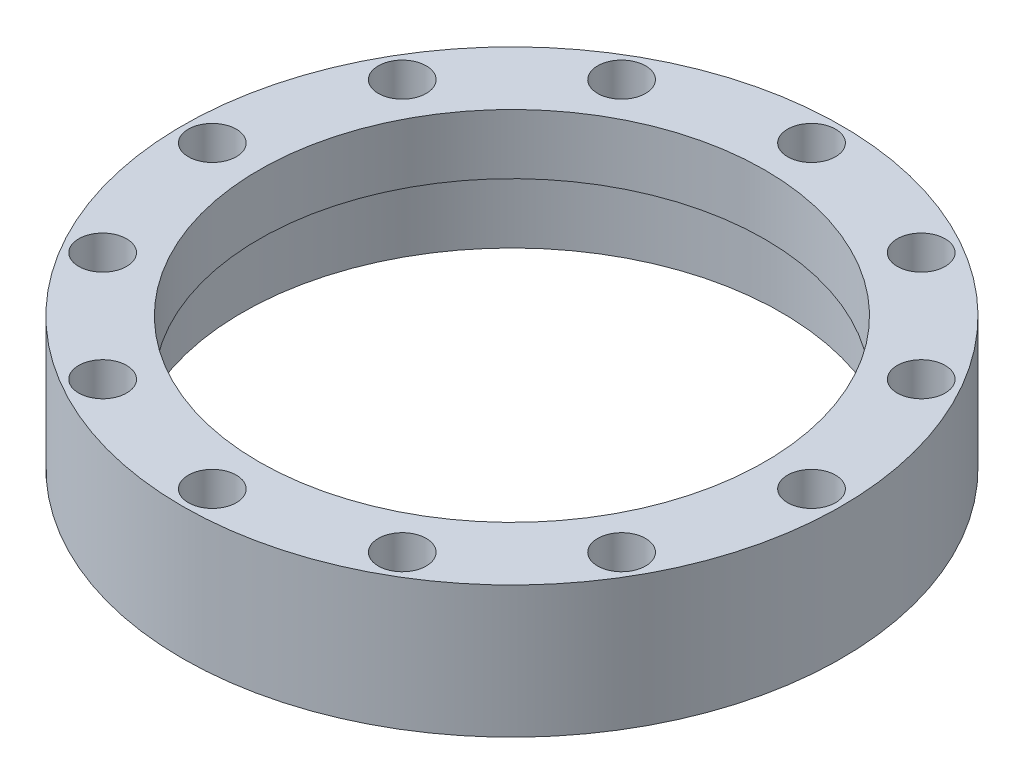
ISO-10303-21;
HEADER;
FILE_DESCRIPTION(('STEP AP214'),'2;1');
FILE_NAME('part.step','',(''),(''),'','','');
FILE_SCHEMA(('AUTOMOTIVE_DESIGN { 1 0 10303 214 1 1 1 1 }'));
ENDSEC;
DATA;
#1=APPLICATION_CONTEXT('core data for automotive mechanical design processes');
#2=APPLICATION_PROTOCOL_DEFINITION('international standard','automotive_design',2000,#1);
#3=PRODUCT_CONTEXT('',#1,'mechanical');
#4=PRODUCT('Part','Part','',(#3));
#5=PRODUCT_RELATED_PRODUCT_CATEGORY('part','',(#4));
#6=PRODUCT_DEFINITION_FORMATION('','',#4);
#7=PRODUCT_DEFINITION_CONTEXT('part definition',#1,'design');
#8=PRODUCT_DEFINITION('design','',#6,#7);
#9=PRODUCT_DEFINITION_SHAPE('','',#8);
#10=(LENGTH_UNIT() NAMED_UNIT(*) SI_UNIT(.MILLI.,.METRE.));
#11=(NAMED_UNIT(*) PLANE_ANGLE_UNIT() SI_UNIT($,.RADIAN.));
#12=(NAMED_UNIT(*) SI_UNIT($,.STERADIAN.) SOLID_ANGLE_UNIT());
#13=UNCERTAINTY_MEASURE_WITH_UNIT(LENGTH_MEASURE(1.E-05),#10,'distance_accuracy_value','');
#14=(GEOMETRIC_REPRESENTATION_CONTEXT(3) GLOBAL_UNCERTAINTY_ASSIGNED_CONTEXT((#13)) GLOBAL_UNIT_ASSIGNED_CONTEXT((#10,
#11,#12)) REPRESENTATION_CONTEXT('',''));
#15=CARTESIAN_POINT('',(0.,0.,0.));
#16=DIRECTION('',(0.,0.,1.));
#17=DIRECTION('',(1.,0.,0.));
#18=AXIS2_PLACEMENT_3D('',#15,#16,#17);
#19=CARTESIAN_POINT('',(0.,11.,-25.));
#20=DIRECTION('',(0.,-1.,0.));
#21=DIRECTION('',(0.,0.,-1.));
#22=AXIS2_PLACEMENT_3D('',#19,#20,#21);
#23=CYLINDRICAL_SURFACE('',#22,1.6);
#24=CARTESIAN_POINT('',(0.,0.,-25.));
#25=DIRECTION('',(0.,1.,0.));
#26=DIRECTION('',(0.,0.,1.));
#27=AXIS2_PLACEMENT_3D('',#24,#25,#26);
#28=CIRCLE('',#27,1.6);
#29=CARTESIAN_POINT('',(0.,0.,-23.4));
#30=VERTEX_POINT('',#29);
#31=EDGE_CURVE('E131',#30,#30,#28,.T.);
#32=ORIENTED_EDGE('',*,*,#31,.F.);
#33=EDGE_LOOP('',(#32));
#34=FACE_BOUND('',#33,.T.);
#35=CARTESIAN_POINT('',(0.,6.,-25.));
#36=DIRECTION('',(0.,1.,0.));
#37=DIRECTION('',(0.,0.,1.));
#38=AXIS2_PLACEMENT_3D('',#35,#36,#37);
#39=CIRCLE('',#38,1.6);
#40=CARTESIAN_POINT('',(0.,6.,-23.4));
#41=VERTEX_POINT('',#40);
#42=EDGE_CURVE('E35',#41,#41,#39,.T.);
#43=ORIENTED_EDGE('',*,*,#42,.T.);
#44=EDGE_LOOP('',(#43));
#45=FACE_BOUND('',#44,.T.);
#46=ADVANCED_FACE('F31',(#34,#45),#23,.F.);
#47=CARTESIAN_POINT('',(12.5000000000001,11.,-21.6506350946109));
#48=DIRECTION('',(0.,-1.,0.));
#49=DIRECTION('',(0.,0.,-1.));
#50=AXIS2_PLACEMENT_3D('',#47,#48,#49);
#51=CYLINDRICAL_SURFACE('',#50,1.6);
#52=CARTESIAN_POINT('',(12.5000000000001,0.,-21.6506350946109));
#53=DIRECTION('',(0.,1.,0.));
#54=DIRECTION('',(0.,0.,1.));
#55=AXIS2_PLACEMENT_3D('',#52,#53,#54);
#56=CIRCLE('',#55,1.6);
#57=CARTESIAN_POINT('',(12.5000000000001,0.,-20.0506350946109));
#58=VERTEX_POINT('',#57);
#59=EDGE_CURVE('E129',#58,#58,#56,.T.);
#60=ORIENTED_EDGE('',*,*,#59,.F.);
#61=EDGE_LOOP('',(#60));
#62=FACE_BOUND('',#61,.T.);
#63=CARTESIAN_POINT('',(12.5000000000001,6.,-21.6506350946109));
#64=DIRECTION('',(0.,1.,0.));
#65=DIRECTION('',(0.,0.,1.));
#66=AXIS2_PLACEMENT_3D('',#63,#64,#65);
#67=CIRCLE('',#66,1.6);
#68=CARTESIAN_POINT('',(12.5000000000001,6.,-20.0506350946109));
#69=VERTEX_POINT('',#68);
#70=EDGE_CURVE('E79',#69,#69,#67,.T.);
#71=ORIENTED_EDGE('',*,*,#70,.T.);
#72=EDGE_LOOP('',(#71));
#73=FACE_BOUND('',#72,.T.);
#74=ADVANCED_FACE('F163',(#62,#73),#51,.F.);
#75=CARTESIAN_POINT('',(21.6506350946111,11.,-12.5));
#76=DIRECTION('',(0.,-1.,0.));
#77=DIRECTION('',(0.,0.,-1.));
#78=AXIS2_PLACEMENT_3D('',#75,#76,#77);
#79=CYLINDRICAL_SURFACE('',#78,1.6);
#80=CARTESIAN_POINT('',(21.6506350946111,0.,-12.5));
#81=DIRECTION('',(0.,1.,0.));
#82=DIRECTION('',(0.,0.,1.));
#83=AXIS2_PLACEMENT_3D('',#80,#81,#82);
#84=CIRCLE('',#83,1.6);
#85=CARTESIAN_POINT('',(21.6506350946111,0.,-10.9));
#86=VERTEX_POINT('',#85);
#87=EDGE_CURVE('E126',#86,#86,#84,.T.);
#88=ORIENTED_EDGE('',*,*,#87,.F.);
#89=EDGE_LOOP('',(#88));
#90=FACE_BOUND('',#89,.T.);
#91=CARTESIAN_POINT('',(21.6506350946111,6.,-12.5));
#92=DIRECTION('',(0.,1.,0.));
#93=DIRECTION('',(0.,0.,1.));
#94=AXIS2_PLACEMENT_3D('',#91,#92,#93);
#95=CIRCLE('',#94,1.6);
#96=CARTESIAN_POINT('',(21.6506350946111,6.,-10.9));
#97=VERTEX_POINT('',#96);
#98=EDGE_CURVE('E77',#97,#97,#95,.T.);
#99=ORIENTED_EDGE('',*,*,#98,.T.);
#100=EDGE_LOOP('',(#99));
#101=FACE_BOUND('',#100,.T.);
#102=ADVANCED_FACE('F169',(#90,#101),#79,.F.);
#103=CARTESIAN_POINT('',(25.0000000000001,11.,1.02782365951626E-13));
#104=DIRECTION('',(0.,-1.,0.));
#105=DIRECTION('',(0.,0.,-1.));
#106=AXIS2_PLACEMENT_3D('',#103,#104,#105);
#107=CYLINDRICAL_SURFACE('',#106,1.6);
#108=CARTESIAN_POINT('',(25.0000000000001,0.,1.02782365951626E-13));
#109=DIRECTION('',(0.,1.,0.));
#110=DIRECTION('',(0.,0.,1.));
#111=AXIS2_PLACEMENT_3D('',#108,#109,#110);
#112=CIRCLE('',#111,1.6);
#113=CARTESIAN_POINT('',(25.0000000000001,0.,1.6000000000001));
#114=VERTEX_POINT('',#113);
#115=EDGE_CURVE('E123',#114,#114,#112,.T.);
#116=ORIENTED_EDGE('',*,*,#115,.F.);
#117=EDGE_LOOP('',(#116));
#118=FACE_BOUND('',#117,.T.);
#119=CARTESIAN_POINT('',(25.0000000000001,6.,1.02782365951626E-13));
#120=DIRECTION('',(0.,1.,0.));
#121=DIRECTION('',(0.,0.,1.));
#122=AXIS2_PLACEMENT_3D('',#119,#120,#121);
#123=CIRCLE('',#122,1.6);
#124=CARTESIAN_POINT('',(25.0000000000001,6.,1.6000000000001));
#125=VERTEX_POINT('',#124);
#126=EDGE_CURVE('E74',#125,#125,#123,.T.);
#127=ORIENTED_EDGE('',*,*,#126,.T.);
#128=EDGE_LOOP('',(#127));
#129=FACE_BOUND('',#128,.T.);
#130=ADVANCED_FACE('F228',(#118,#129),#107,.F.);
#131=CARTESIAN_POINT('',(21.6506350946111,11.,12.5000000000002));
#132=DIRECTION('',(0.,-1.,0.));
#133=DIRECTION('',(0.,0.,-1.));
#134=AXIS2_PLACEMENT_3D('',#131,#132,#133);
#135=CYLINDRICAL_SURFACE('',#134,1.6);
#136=CARTESIAN_POINT('',(21.6506350946111,0.,12.5000000000002));
#137=DIRECTION('',(0.,1.,0.));
#138=DIRECTION('',(0.,0.,1.));
#139=AXIS2_PLACEMENT_3D('',#136,#137,#138);
#140=CIRCLE('',#139,1.6);
#141=CARTESIAN_POINT('',(21.6506350946111,0.,14.1000000000002));
#142=VERTEX_POINT('',#141);
#143=EDGE_CURVE('E120',#142,#142,#140,.T.);
#144=ORIENTED_EDGE('',*,*,#143,.F.);
#145=EDGE_LOOP('',(#144));
#146=FACE_BOUND('',#145,.T.);
#147=CARTESIAN_POINT('',(21.6506350946111,6.,12.5000000000002));
#148=DIRECTION('',(0.,1.,0.));
#149=DIRECTION('',(0.,0.,1.));
#150=AXIS2_PLACEMENT_3D('',#147,#148,#149);
#151=CIRCLE('',#150,1.6);
#152=CARTESIAN_POINT('',(21.6506350946111,6.,14.1000000000002));
#153=VERTEX_POINT('',#152);
#154=EDGE_CURVE('E71',#153,#153,#151,.T.);
#155=ORIENTED_EDGE('',*,*,#154,.T.);
#156=EDGE_LOOP('',(#155));
#157=FACE_BOUND('',#156,.T.);
#158=ADVANCED_FACE('F237',(#146,#157),#135,.F.);
#159=CARTESIAN_POINT('',(12.5000000000001,11.,21.6506350946112));
#160=DIRECTION('',(0.,-1.,0.));
#161=DIRECTION('',(0.,0.,-1.));
#162=AXIS2_PLACEMENT_3D('',#159,#160,#161);
#163=CYLINDRICAL_SURFACE('',#162,1.6);
#164=CARTESIAN_POINT('',(12.5000000000001,0.,21.6506350946112));
#165=DIRECTION('',(0.,1.,0.));
#166=DIRECTION('',(0.,0.,1.));
#167=AXIS2_PLACEMENT_3D('',#164,#165,#166);
#168=CIRCLE('',#167,1.6);
#169=CARTESIAN_POINT('',(12.5000000000001,0.,23.2506350946112));
#170=VERTEX_POINT('',#169);
#171=EDGE_CURVE('E117',#170,#170,#168,.T.);
#172=ORIENTED_EDGE('',*,*,#171,.F.);
#173=EDGE_LOOP('',(#172));
#174=FACE_BOUND('',#173,.T.);
#175=CARTESIAN_POINT('',(12.5000000000001,6.,21.6506350946112));
#176=DIRECTION('',(0.,1.,0.));
#177=DIRECTION('',(0.,0.,1.));
#178=AXIS2_PLACEMENT_3D('',#175,#176,#177);
#179=CIRCLE('',#178,1.6);
#180=CARTESIAN_POINT('',(12.5000000000001,6.,23.2506350946112));
#181=VERTEX_POINT('',#180);
#182=EDGE_CURVE('E68',#181,#181,#179,.T.);
#183=ORIENTED_EDGE('',*,*,#182,.T.);
#184=EDGE_LOOP('',(#183));
#185=FACE_BOUND('',#184,.T.);
#186=ADVANCED_FACE('F247',(#174,#185),#163,.F.);
#187=CARTESIAN_POINT('',(0.,11.,25.0000000000002));
#188=DIRECTION('',(0.,-1.,0.));
#189=DIRECTION('',(0.,0.,-1.));
#190=AXIS2_PLACEMENT_3D('',#187,#188,#189);
#191=CYLINDRICAL_SURFACE('',#190,1.6);
#192=CARTESIAN_POINT('',(0.,0.,25.0000000000002));
#193=DIRECTION('',(0.,1.,0.));
#194=DIRECTION('',(0.,0.,1.));
#195=AXIS2_PLACEMENT_3D('',#192,#193,#194);
#196=CIRCLE('',#195,1.6);
#197=CARTESIAN_POINT('',(0.,0.,26.6000000000002));
#198=VERTEX_POINT('',#197);
#199=EDGE_CURVE('E114',#198,#198,#196,.T.);
#200=ORIENTED_EDGE('',*,*,#199,.F.);
#201=EDGE_LOOP('',(#200));
#202=FACE_BOUND('',#201,.T.);
#203=CARTESIAN_POINT('',(0.,6.,25.0000000000002));
#204=DIRECTION('',(0.,1.,0.));
#205=DIRECTION('',(0.,0.,1.));
#206=AXIS2_PLACEMENT_3D('',#203,#204,#205);
#207=CIRCLE('',#206,1.6);
#208=CARTESIAN_POINT('',(0.,6.,26.6000000000002));
#209=VERTEX_POINT('',#208);
#210=EDGE_CURVE('E65',#209,#209,#207,.T.);
#211=ORIENTED_EDGE('',*,*,#210,.T.);
#212=EDGE_LOOP('',(#211));
#213=FACE_BOUND('',#212,.T.);
#214=ADVANCED_FACE('F257',(#202,#213),#191,.F.);
#215=CARTESIAN_POINT('',(-12.5,11.,21.6506350946112));
#216=DIRECTION('',(0.,-1.,0.));
#217=DIRECTION('',(0.,0.,-1.));
#218=AXIS2_PLACEMENT_3D('',#215,#216,#217);
#219=CYLINDRICAL_SURFACE('',#218,1.6);
#220=CARTESIAN_POINT('',(-12.5,0.,21.6506350946112));
#221=DIRECTION('',(0.,1.,0.));
#222=DIRECTION('',(0.,0.,1.));
#223=AXIS2_PLACEMENT_3D('',#220,#221,#222);
#224=CIRCLE('',#223,1.6);
#225=CARTESIAN_POINT('',(-12.5,0.,23.2506350946112));
#226=VERTEX_POINT('',#225);
#227=EDGE_CURVE('E111',#226,#226,#224,.T.);
#228=ORIENTED_EDGE('',*,*,#227,.F.);
#229=EDGE_LOOP('',(#228));
#230=FACE_BOUND('',#229,.T.);
#231=CARTESIAN_POINT('',(-12.5,6.,21.6506350946112));
#232=DIRECTION('',(0.,1.,0.));
#233=DIRECTION('',(0.,0.,1.));
#234=AXIS2_PLACEMENT_3D('',#231,#232,#233);
#235=CIRCLE('',#234,1.6);
#236=CARTESIAN_POINT('',(-12.5,6.,23.2506350946112));
#237=VERTEX_POINT('',#236);
#238=EDGE_CURVE('E62',#237,#237,#235,.T.);
#239=ORIENTED_EDGE('',*,*,#238,.T.);
#240=EDGE_LOOP('',(#239));
#241=FACE_BOUND('',#240,.T.);
#242=ADVANCED_FACE('F267',(#230,#241),#219,.F.);
#243=CARTESIAN_POINT('',(-21.6506350946111,11.,12.5000000000002));
#244=DIRECTION('',(0.,-1.,0.));
#245=DIRECTION('',(0.,0.,-1.));
#246=AXIS2_PLACEMENT_3D('',#243,#244,#245);
#247=CYLINDRICAL_SURFACE('',#246,1.6);
#248=CARTESIAN_POINT('',(-21.6506350946111,0.,12.5000000000002));
#249=DIRECTION('',(0.,1.,0.));
#250=DIRECTION('',(0.,0.,1.));
#251=AXIS2_PLACEMENT_3D('',#248,#249,#250);
#252=CIRCLE('',#251,1.6);
#253=CARTESIAN_POINT('',(-21.6506350946111,0.,14.1000000000002));
#254=VERTEX_POINT('',#253);
#255=EDGE_CURVE('E108',#254,#254,#252,.T.);
#256=ORIENTED_EDGE('',*,*,#255,.F.);
#257=EDGE_LOOP('',(#256));
#258=FACE_BOUND('',#257,.T.);
#259=CARTESIAN_POINT('',(-21.6506350946111,6.,12.5000000000002));
#260=DIRECTION('',(0.,1.,0.));
#261=DIRECTION('',(0.,0.,1.));
#262=AXIS2_PLACEMENT_3D('',#259,#260,#261);
#263=CIRCLE('',#262,1.6);
#264=CARTESIAN_POINT('',(-21.6506350946111,6.,14.1000000000002));
#265=VERTEX_POINT('',#264);
#266=EDGE_CURVE('E59',#265,#265,#263,.T.);
#267=ORIENTED_EDGE('',*,*,#266,.T.);
#268=EDGE_LOOP('',(#267));
#269=FACE_BOUND('',#268,.T.);
#270=ADVANCED_FACE('F277',(#258,#269),#247,.F.);
#271=CARTESIAN_POINT('',(-25.0000000000001,11.,1.15359111152458E-13));
#272=DIRECTION('',(0.,-1.,0.));
#273=DIRECTION('',(0.,0.,-1.));
#274=AXIS2_PLACEMENT_3D('',#271,#272,#273);
#275=CYLINDRICAL_SURFACE('',#274,1.6);
#276=CARTESIAN_POINT('',(-25.0000000000001,0.,1.15359111152458E-13));
#277=DIRECTION('',(0.,1.,0.));
#278=DIRECTION('',(0.,0.,1.));
#279=AXIS2_PLACEMENT_3D('',#276,#277,#278);
#280=CIRCLE('',#279,1.6);
#281=CARTESIAN_POINT('',(-25.0000000000001,0.,1.60000000000012));
#282=VERTEX_POINT('',#281);
#283=EDGE_CURVE('E105',#282,#282,#280,.T.);
#284=ORIENTED_EDGE('',*,*,#283,.F.);
#285=EDGE_LOOP('',(#284));
#286=FACE_BOUND('',#285,.T.);
#287=CARTESIAN_POINT('',(-25.0000000000001,6.,1.15359111152458E-13));
#288=DIRECTION('',(0.,1.,0.));
#289=DIRECTION('',(0.,0.,1.));
#290=AXIS2_PLACEMENT_3D('',#287,#288,#289);
#291=CIRCLE('',#290,1.6);
#292=CARTESIAN_POINT('',(-25.0000000000001,6.,1.60000000000012));
#293=VERTEX_POINT('',#292);
#294=EDGE_CURVE('E56',#293,#293,#291,.T.);
#295=ORIENTED_EDGE('',*,*,#294,.T.);
#296=EDGE_LOOP('',(#295));
#297=FACE_BOUND('',#296,.T.);
#298=ADVANCED_FACE('F287',(#286,#297),#275,.F.);
#299=CARTESIAN_POINT('',(-21.6506350946111,11.,-12.4999999999999));
#300=DIRECTION('',(0.,-1.,0.));
#301=DIRECTION('',(0.,0.,-1.));
#302=AXIS2_PLACEMENT_3D('',#299,#300,#301);
#303=CYLINDRICAL_SURFACE('',#302,1.6);
#304=CARTESIAN_POINT('',(-21.6506350946111,0.,-12.4999999999999));
#305=DIRECTION('',(0.,1.,0.));
#306=DIRECTION('',(0.,0.,1.));
#307=AXIS2_PLACEMENT_3D('',#304,#305,#306);
#308=CIRCLE('',#307,1.6);
#309=CARTESIAN_POINT('',(-21.6506350946111,0.,-10.8999999999999));
#310=VERTEX_POINT('',#309);
#311=EDGE_CURVE('E102',#310,#310,#308,.T.);
#312=ORIENTED_EDGE('',*,*,#311,.F.);
#313=EDGE_LOOP('',(#312));
#314=FACE_BOUND('',#313,.T.);
#315=CARTESIAN_POINT('',(-21.6506350946111,6.,-12.4999999999999));
#316=DIRECTION('',(0.,1.,0.));
#317=DIRECTION('',(0.,0.,1.));
#318=AXIS2_PLACEMENT_3D('',#315,#316,#317);
#319=CIRCLE('',#318,1.6);
#320=CARTESIAN_POINT('',(-21.6506350946111,6.,-10.8999999999999));
#321=VERTEX_POINT('',#320);
#322=EDGE_CURVE('E52',#321,#321,#319,.T.);
#323=ORIENTED_EDGE('',*,*,#322,.T.);
#324=EDGE_LOOP('',(#323));
#325=FACE_BOUND('',#324,.T.);
#326=ADVANCED_FACE('F297',(#314,#325),#303,.F.);
#327=CARTESIAN_POINT('',(-12.5000000000001,11.,-21.6506350946109));
#328=DIRECTION('',(0.,-1.,0.));
#329=DIRECTION('',(0.,0.,-1.));
#330=AXIS2_PLACEMENT_3D('',#327,#328,#329);
#331=CYLINDRICAL_SURFACE('',#330,1.6);
#332=CARTESIAN_POINT('',(-12.5000000000001,0.,-21.6506350946109));
#333=DIRECTION('',(0.,1.,0.));
#334=DIRECTION('',(0.,0.,1.));
#335=AXIS2_PLACEMENT_3D('',#332,#333,#334);
#336=CIRCLE('',#335,1.6);
#337=CARTESIAN_POINT('',(-12.5000000000001,0.,-20.0506350946109));
#338=VERTEX_POINT('',#337);
#339=EDGE_CURVE('E99',#338,#338,#336,.T.);
#340=ORIENTED_EDGE('',*,*,#339,.F.);
#341=EDGE_LOOP('',(#340));
#342=FACE_BOUND('',#341,.T.);
#343=CARTESIAN_POINT('',(-12.5000000000001,6.,-21.6506350946109));
#344=DIRECTION('',(0.,1.,0.));
#345=DIRECTION('',(0.,0.,1.));
#346=AXIS2_PLACEMENT_3D('',#343,#344,#345);
#347=CIRCLE('',#346,1.6);
#348=CARTESIAN_POINT('',(-12.5000000000001,6.,-20.0506350946109));
#349=VERTEX_POINT('',#348);
#350=EDGE_CURVE('E49',#349,#349,#347,.T.);
#351=ORIENTED_EDGE('',*,*,#350,.T.);
#352=EDGE_LOOP('',(#351));
#353=FACE_BOUND('',#352,.T.);
#354=ADVANCED_FACE('F144',(#342,#353),#331,.F.);
#355=CARTESIAN_POINT('',(0.,11.,0.));
#356=DIRECTION('',(0.,-1.,0.));
#357=DIRECTION('',(0.,0.,-1.));
#358=AXIS2_PLACEMENT_3D('',#355,#356,#357);
#359=CYLINDRICAL_SURFACE('',#358,22.5);
#360=CARTESIAN_POINT('',(0.,0.,0.));
#361=DIRECTION('',(0.,1.,0.));
#362=DIRECTION('',(0.,0.,1.));
#363=AXIS2_PLACEMENT_3D('',#360,#361,#362);
#364=CIRCLE('',#363,22.5);
#365=CARTESIAN_POINT('',(0.,0.,22.5));
#366=VERTEX_POINT('',#365);
#367=EDGE_CURVE('E44',#366,#366,#364,.T.);
#368=ORIENTED_EDGE('',*,*,#367,.F.);
#369=EDGE_LOOP('',(#368));
#370=FACE_BOUND('',#369,.T.);
#371=CARTESIAN_POINT('',(0.,6.,0.));
#372=DIRECTION('',(0.,1.,0.));
#373=DIRECTION('',(0.,0.,1.));
#374=AXIS2_PLACEMENT_3D('',#371,#372,#373);
#375=CIRCLE('',#374,22.5);
#376=CARTESIAN_POINT('',(0.,6.,22.5));
#377=VERTEX_POINT('',#376);
#378=EDGE_CURVE('E93',#377,#377,#375,.T.);
#379=ORIENTED_EDGE('',*,*,#378,.T.);
#380=EDGE_LOOP('',(#379));
#381=FACE_BOUND('',#380,.T.);
#382=ADVANCED_FACE('F140',(#370,#381),#359,.F.);
#383=CARTESIAN_POINT('',(0.,11.,0.));
#384=DIRECTION('',(0.,1.,0.));
#385=DIRECTION('',(0.,0.,1.));
#386=AXIS2_PLACEMENT_3D('',#383,#384,#385);
#387=PLANE('',#386);
#388=CARTESIAN_POINT('',(-21.6506350946099,11.,12.5000000000006));
#389=DIRECTION('',(0.,1.,0.));
#390=DIRECTION('',(0.,0.,1.));
#391=AXIS2_PLACEMENT_3D('',#388,#389,#390);
#392=CIRCLE('',#391,2.00000000000143);
#393=CARTESIAN_POINT('',(-21.6506350946099,11.,14.500000000002));
#394=VERTEX_POINT('',#393);
#395=EDGE_CURVE('E590',#394,#394,#392,.T.);
#396=ORIENTED_EDGE('',*,*,#395,.F.);
#397=EDGE_LOOP('',(#396));
#398=FACE_BOUND('',#397,.T.);
#399=CARTESIAN_POINT('',(-12.4999999999987,11.,21.6506350946113));
#400=DIRECTION('',(0.,1.,0.));
#401=DIRECTION('',(0.,0.,1.));
#402=AXIS2_PLACEMENT_3D('',#399,#400,#401);
#403=CIRCLE('',#402,2.00000000000157);
#404=CARTESIAN_POINT('',(-12.4999999999987,11.,23.6506350946129));
#405=VERTEX_POINT('',#404);
#406=EDGE_CURVE('E597',#405,#405,#403,.T.);
#407=ORIENTED_EDGE('',*,*,#406,.F.);
#408=EDGE_LOOP('',(#407));
#409=FACE_BOUND('',#408,.T.);
#410=CARTESIAN_POINT('',(1.41493638660955E-12,11.,25.));
#411=DIRECTION('',(0.,1.,0.));
#412=DIRECTION('',(0.,0.,1.));
#413=AXIS2_PLACEMENT_3D('',#410,#411,#412);
#414=CIRCLE('',#413,2.00000000000152);
#415=CARTESIAN_POINT('',(1.41493638660955E-12,11.,27.0000000000015));
#416=VERTEX_POINT('',#415);
#417=EDGE_CURVE('E603',#416,#416,#414,.T.);
#418=ORIENTED_EDGE('',*,*,#417,.F.);
#419=EDGE_LOOP('',(#418));
#420=FACE_BOUND('',#419,.T.);
#421=CARTESIAN_POINT('',(12.5000000000013,11.,21.6506350946106));
#422=DIRECTION('',(0.,1.,0.));
#423=DIRECTION('',(0.,0.,1.));
#424=AXIS2_PLACEMENT_3D('',#421,#422,#423);
#425=CIRCLE('',#424,2.00000000000131);
#426=CARTESIAN_POINT('',(12.5000000000013,11.,23.6506350946119));
#427=VERTEX_POINT('',#426);
#428=EDGE_CURVE('E609',#427,#427,#425,.T.);
#429=ORIENTED_EDGE('',*,*,#428,.F.);
#430=EDGE_LOOP('',(#429));
#431=FACE_BOUND('',#430,.T.);
#432=CARTESIAN_POINT('',(21.650635094612,11.,12.4999999999994));
#433=DIRECTION('',(0.,1.,0.));
#434=DIRECTION('',(0.,0.,1.));
#435=AXIS2_PLACEMENT_3D('',#432,#433,#434);
#436=CIRCLE('',#435,2.00000000000095);
#437=CARTESIAN_POINT('',(21.650635094612,11.,14.5000000000003));
#438=VERTEX_POINT('',#437);
#439=EDGE_CURVE('E566',#438,#438,#436,.T.);
#440=ORIENTED_EDGE('',*,*,#439,.F.);
#441=EDGE_LOOP('',(#440));
#442=FACE_BOUND('',#441,.T.);
#443=CARTESIAN_POINT('',(25.0000000000007,11.,-7.05950310263298E-13));
#444=DIRECTION('',(0.,1.,0.));
#445=DIRECTION('',(0.,0.,1.));
#446=AXIS2_PLACEMENT_3D('',#443,#444,#445);
#447=CIRCLE('',#446,2.00000000000056);
#448=CARTESIAN_POINT('',(25.0000000000007,11.,1.99999999999985));
#449=VERTEX_POINT('',#448);
#450=EDGE_CURVE('E573',#449,#449,#447,.T.);
#451=ORIENTED_EDGE('',*,*,#450,.F.);
#452=EDGE_LOOP('',(#451));
#453=FACE_BOUND('',#452,.T.);
#454=CARTESIAN_POINT('',(21.6506350946113,11.,-12.5000000000006));
#455=DIRECTION('',(0.,1.,0.));
#456=DIRECTION('',(0.,0.,1.));
#457=AXIS2_PLACEMENT_3D('',#454,#455,#456);
#458=CIRCLE('',#457,2.00000000000022);
#459=CARTESIAN_POINT('',(21.6506350946113,11.,-10.5000000000004));
#460=VERTEX_POINT('',#459);
#461=EDGE_CURVE('E579',#460,#460,#458,.T.);
#462=ORIENTED_EDGE('',*,*,#461,.F.);
#463=EDGE_LOOP('',(#462));
#464=FACE_BOUND('',#463,.T.);
#465=CARTESIAN_POINT('',(12.5,11.,-21.650635094611));
#466=DIRECTION('',(0.,1.,0.));
#467=DIRECTION('',(0.,0.,1.));
#468=AXIS2_PLACEMENT_3D('',#465,#466,#467);
#469=CIRCLE('',#468,2.);
#470=CARTESIAN_POINT('',(12.5,11.,-19.650635094611));
#471=VERTEX_POINT('',#470);
#472=EDGE_CURVE('E585',#471,#471,#469,.T.);
#473=ORIENTED_EDGE('',*,*,#472,.F.);
#474=EDGE_LOOP('',(#473));
#475=FACE_BOUND('',#474,.T.);
#476=CARTESIAN_POINT('',(-24.9999999999993,11.,7.09011927261166E-13));
#477=DIRECTION('',(0.,1.,0.));
#478=DIRECTION('',(0.,0.,1.));
#479=AXIS2_PLACEMENT_3D('',#476,#477,#478);
#480=CIRCLE('',#479,2.00000000000114);
#481=CARTESIAN_POINT('',(-24.9999999999993,11.,2.00000000000185));
#482=VERTEX_POINT('',#481);
#483=EDGE_CURVE('E626',#482,#482,#480,.T.);
#484=ORIENTED_EDGE('',*,*,#483,.F.);
#485=EDGE_LOOP('',(#484));
#486=FACE_BOUND('',#485,.T.);
#487=CARTESIAN_POINT('',(-21.6506350946106,11.,-12.4999999999994));
#488=DIRECTION('',(0.,1.,0.));
#489=DIRECTION('',(0.,0.,1.));
#490=AXIS2_PLACEMENT_3D('',#487,#488,#489);
#491=CIRCLE('',#490,2.00000000000082);
#492=CARTESIAN_POINT('',(-21.6506350946106,11.,-10.4999999999986));
#493=VERTEX_POINT('',#492);
#494=EDGE_CURVE('E620',#493,#493,#491,.T.);
#495=ORIENTED_EDGE('',*,*,#494,.F.);
#496=EDGE_LOOP('',(#495));
#497=FACE_BOUND('',#496,.T.);
#498=CARTESIAN_POINT('',(-12.4999999999997,11.,-21.6506350946111));
#499=DIRECTION('',(0.,1.,0.));
#500=DIRECTION('',(0.,0.,1.));
#501=AXIS2_PLACEMENT_3D('',#498,#499,#500);
#502=CIRCLE('',#501,2.);
#503=CARTESIAN_POINT('',(-12.4999999999997,11.,-19.6506350946111));
#504=VERTEX_POINT('',#503);
#505=EDGE_CURVE('E614',#504,#504,#502,.T.);
#506=ORIENTED_EDGE('',*,*,#505,.F.);
#507=EDGE_LOOP('',(#506));
#508=FACE_BOUND('',#507,.T.);
#509=CARTESIAN_POINT('',(0.,11.,-25.));
#510=DIRECTION('',(0.,1.,0.));
#511=DIRECTION('',(0.,0.,1.));
#512=AXIS2_PLACEMENT_3D('',#509,#510,#511);
#513=CIRCLE('',#512,2.);
#514=CARTESIAN_POINT('',(0.,11.,-23.));
#515=VERTEX_POINT('',#514);
#516=EDGE_CURVE('E561',#515,#515,#513,.T.);
#517=ORIENTED_EDGE('',*,*,#516,.F.);
#518=EDGE_LOOP('',(#517));
#519=FACE_BOUND('',#518,.T.);
#520=CARTESIAN_POINT('',(0.,11.,0.));
#521=DIRECTION('',(0.,1.,0.));
#522=DIRECTION('',(0.,0.,1.));
#523=AXIS2_PLACEMENT_3D('',#520,#521,#522);
#524=CIRCLE('',#523,27.5);
#525=CARTESIAN_POINT('',(0.,11.,27.5));
#526=VERTEX_POINT('',#525);
#527=EDGE_CURVE('E10',#526,#526,#524,.T.);
#528=ORIENTED_EDGE('',*,*,#527,.T.);
#529=EDGE_LOOP('',(#528));
#530=FACE_BOUND('',#529,.T.);
#531=CARTESIAN_POINT('',(0.,11.,0.));
#532=DIRECTION('',(0.,1.,0.));
#533=DIRECTION('',(0.,0.,1.));
#534=AXIS2_PLACEMENT_3D('',#531,#532,#533);
#535=CIRCLE('',#534,21.1);
#536=CARTESIAN_POINT('',(0.,11.,21.1));
#537=VERTEX_POINT('',#536);
#538=EDGE_CURVE('E84',#537,#537,#535,.T.);
#539=ORIENTED_EDGE('',*,*,#538,.F.);
#540=EDGE_LOOP('',(#539));
#541=FACE_BOUND('',#540,.T.);
#542=ADVANCED_FACE('F143',(#398,#409,#420,#431,#442,#453,#464,#475,#486,#497,#508,#519,#530,
#541),#387,.T.);
#543=CARTESIAN_POINT('',(0.,0.,0.));
#544=DIRECTION('',(0.,1.,0.));
#545=DIRECTION('',(0.,0.,1.));
#546=AXIS2_PLACEMENT_3D('',#543,#544,#545);
#547=PLANE('',#546);
#548=CARTESIAN_POINT('',(0.,0.,0.));
#549=DIRECTION('',(0.,1.,0.));
#550=DIRECTION('',(0.,0.,1.));
#551=AXIS2_PLACEMENT_3D('',#548,#549,#550);
#552=CIRCLE('',#551,27.5);
#553=CARTESIAN_POINT('',(0.,0.,27.5));
#554=VERTEX_POINT('',#553);
#555=EDGE_CURVE('E39',#554,#554,#552,.T.);
#556=ORIENTED_EDGE('',*,*,#555,.F.);
#557=EDGE_LOOP('',(#556));
#558=FACE_BOUND('',#557,.T.);
#559=ORIENTED_EDGE('',*,*,#367,.T.);
#560=EDGE_LOOP('',(#559));
#561=FACE_BOUND('',#560,.T.);
#562=ORIENTED_EDGE('',*,*,#31,.T.);
#563=EDGE_LOOP('',(#562));
#564=FACE_BOUND('',#563,.T.);
#565=ORIENTED_EDGE('',*,*,#59,.T.);
#566=EDGE_LOOP('',(#565));
#567=FACE_BOUND('',#566,.T.);
#568=ORIENTED_EDGE('',*,*,#87,.T.);
#569=EDGE_LOOP('',(#568));
#570=FACE_BOUND('',#569,.T.);
#571=ORIENTED_EDGE('',*,*,#115,.T.);
#572=EDGE_LOOP('',(#571));
#573=FACE_BOUND('',#572,.T.);
#574=ORIENTED_EDGE('',*,*,#143,.T.);
#575=EDGE_LOOP('',(#574));
#576=FACE_BOUND('',#575,.T.);
#577=ORIENTED_EDGE('',*,*,#171,.T.);
#578=EDGE_LOOP('',(#577));
#579=FACE_BOUND('',#578,.T.);
#580=ORIENTED_EDGE('',*,*,#199,.T.);
#581=EDGE_LOOP('',(#580));
#582=FACE_BOUND('',#581,.T.);
#583=ORIENTED_EDGE('',*,*,#227,.T.);
#584=EDGE_LOOP('',(#583));
#585=FACE_BOUND('',#584,.T.);
#586=ORIENTED_EDGE('',*,*,#255,.T.);
#587=EDGE_LOOP('',(#586));
#588=FACE_BOUND('',#587,.T.);
#589=ORIENTED_EDGE('',*,*,#283,.T.);
#590=EDGE_LOOP('',(#589));
#591=FACE_BOUND('',#590,.T.);
#592=ORIENTED_EDGE('',*,*,#311,.T.);
#593=EDGE_LOOP('',(#592));
#594=FACE_BOUND('',#593,.T.);
#595=ORIENTED_EDGE('',*,*,#339,.T.);
#596=EDGE_LOOP('',(#595));
#597=FACE_BOUND('',#596,.T.);
#598=ADVANCED_FACE('F138',(#558,#561,#564,#567,#570,#573,#576,#579,#582,#585,#588,#591,#594,
#597),#547,.F.);
#599=CARTESIAN_POINT('',(0.,11.,0.));
#600=DIRECTION('',(0.,-1.,0.));
#601=DIRECTION('',(0.,0.,-1.));
#602=AXIS2_PLACEMENT_3D('',#599,#600,#601);
#603=CYLINDRICAL_SURFACE('',#602,27.5);
#604=ORIENTED_EDGE('',*,*,#527,.F.);
#605=EDGE_LOOP('',(#604));
#606=FACE_BOUND('',#605,.T.);
#607=ORIENTED_EDGE('',*,*,#555,.T.);
#608=EDGE_LOOP('',(#607));
#609=FACE_BOUND('',#608,.T.);
#610=ADVANCED_FACE('F33',(#606,#609),#603,.T.);
#611=CARTESIAN_POINT('',(0.,6.,0.));
#612=DIRECTION('',(0.,1.,0.));
#613=DIRECTION('',(0.,0.,1.));
#614=AXIS2_PLACEMENT_3D('',#611,#612,#613);
#615=PLANE('',#614);
#616=CARTESIAN_POINT('',(0.,6.,0.));
#617=DIRECTION('',(0.,1.,0.));
#618=DIRECTION('',(0.,0.,1.));
#619=AXIS2_PLACEMENT_3D('',#616,#617,#618);
#620=CIRCLE('',#619,21.1);
#621=CARTESIAN_POINT('',(0.,6.,21.1));
#622=VERTEX_POINT('',#621);
#623=EDGE_CURVE('E88',#622,#622,#620,.T.);
#624=ORIENTED_EDGE('',*,*,#623,.T.);
#625=EDGE_LOOP('',(#624));
#626=FACE_BOUND('',#625,.T.);
#627=ORIENTED_EDGE('',*,*,#378,.F.);
#628=EDGE_LOOP('',(#627));
#629=FACE_BOUND('',#628,.T.);
#630=ADVANCED_FACE('F148',(#626,#629),#615,.F.);
#631=CARTESIAN_POINT('',(0.,6.,0.));
#632=DIRECTION('',(0.,1.,0.));
#633=DIRECTION('',(0.,0.,1.));
#634=AXIS2_PLACEMENT_3D('',#631,#632,#633);
#635=CYLINDRICAL_SURFACE('',#634,21.1);
#636=ORIENTED_EDGE('',*,*,#623,.F.);
#637=EDGE_LOOP('',(#636));
#638=FACE_BOUND('',#637,.T.);
#639=ORIENTED_EDGE('',*,*,#538,.T.);
#640=EDGE_LOOP('',(#639));
#641=FACE_BOUND('',#640,.T.);
#642=ADVANCED_FACE('F150',(#638,#641),#635,.F.);
#643=CARTESIAN_POINT('',(-12.4999999999997,6.,-21.6506350946111));
#644=DIRECTION('',(0.,1.,0.));
#645=DIRECTION('',(0.,0.,1.));
#646=AXIS2_PLACEMENT_3D('',#643,#644,#645);
#647=CYLINDRICAL_SURFACE('',#646,2.);
#648=CARTESIAN_POINT('',(-12.4999999999997,6.,-21.6506350946111));
#649=DIRECTION('',(0.,1.,0.));
#650=DIRECTION('',(0.,0.,1.));
#651=AXIS2_PLACEMENT_3D('',#648,#649,#650);
#652=CIRCLE('',#651,2.);
#653=CARTESIAN_POINT('',(-12.4999999999997,6.,-19.6506350946111));
#654=VERTEX_POINT('',#653);
#655=EDGE_CURVE('E617',#654,#654,#652,.T.);
#656=ORIENTED_EDGE('',*,*,#655,.F.);
#657=EDGE_LOOP('',(#656));
#658=FACE_BOUND('',#657,.T.);
#659=ORIENTED_EDGE('',*,*,#505,.T.);
#660=EDGE_LOOP('',(#659));
#661=FACE_BOUND('',#660,.T.);
#662=ADVANCED_FACE('F157',(#658,#661),#647,.F.);
#663=CARTESIAN_POINT('',(-12.4999999999997,6.,-21.6506350946111));
#664=DIRECTION('',(0.,1.,0.));
#665=DIRECTION('',(0.,0.,1.));
#666=AXIS2_PLACEMENT_3D('',#663,#664,#665);
#667=PLANE('',#666);
#668=ORIENTED_EDGE('',*,*,#350,.F.);
#669=EDGE_LOOP('',(#668));
#670=FACE_BOUND('',#669,.T.);
#671=ORIENTED_EDGE('',*,*,#655,.T.);
#672=EDGE_LOOP('',(#671));
#673=FACE_BOUND('',#672,.T.);
#674=ADVANCED_FACE('F324',(#670,#673),#667,.T.);
#675=CARTESIAN_POINT('',(-21.6506350946106,6.,-12.4999999999994));
#676=DIRECTION('',(0.,1.,0.));
#677=DIRECTION('',(0.,0.,1.));
#678=AXIS2_PLACEMENT_3D('',#675,#676,#677);
#679=CYLINDRICAL_SURFACE('',#678,2.00000000000082);
#680=CARTESIAN_POINT('',(-21.6506350946106,6.,-12.4999999999994));
#681=DIRECTION('',(0.,1.,0.));
#682=DIRECTION('',(0.,0.,1.));
#683=AXIS2_PLACEMENT_3D('',#680,#681,#682);
#684=CIRCLE('',#683,2.00000000000082);
#685=CARTESIAN_POINT('',(-21.6506350946106,6.,-10.4999999999986));
#686=VERTEX_POINT('',#685);
#687=EDGE_CURVE('E623',#686,#686,#684,.T.);
#688=ORIENTED_EDGE('',*,*,#687,.F.);
#689=EDGE_LOOP('',(#688));
#690=FACE_BOUND('',#689,.T.);
#691=ORIENTED_EDGE('',*,*,#494,.T.);
#692=EDGE_LOOP('',(#691));
#693=FACE_BOUND('',#692,.T.);
#694=ADVANCED_FACE('F334',(#690,#693),#679,.F.);
#695=CARTESIAN_POINT('',(-21.6506350946106,6.,-12.4999999999994));
#696=DIRECTION('',(0.,1.,0.));
#697=DIRECTION('',(0.,0.,1.));
#698=AXIS2_PLACEMENT_3D('',#695,#696,#697);
#699=PLANE('',#698);
#700=ORIENTED_EDGE('',*,*,#322,.F.);
#701=EDGE_LOOP('',(#700));
#702=FACE_BOUND('',#701,.T.);
#703=ORIENTED_EDGE('',*,*,#687,.T.);
#704=EDGE_LOOP('',(#703));
#705=FACE_BOUND('',#704,.T.);
#706=ADVANCED_FACE('F344',(#702,#705),#699,.T.);
#707=CARTESIAN_POINT('',(-24.9999999999993,6.,7.09011927261166E-13));
#708=DIRECTION('',(0.,1.,0.));
#709=DIRECTION('',(0.,0.,1.));
#710=AXIS2_PLACEMENT_3D('',#707,#708,#709);
#711=CYLINDRICAL_SURFACE('',#710,2.00000000000114);
#712=CARTESIAN_POINT('',(-24.9999999999993,6.,7.09011927261166E-13));
#713=DIRECTION('',(0.,1.,0.));
#714=DIRECTION('',(0.,0.,1.));
#715=AXIS2_PLACEMENT_3D('',#712,#713,#714);
#716=CIRCLE('',#715,2.00000000000114);
#717=CARTESIAN_POINT('',(-24.9999999999993,6.,2.00000000000185));
#718=VERTEX_POINT('',#717);
#719=EDGE_CURVE('E594',#718,#718,#716,.T.);
#720=ORIENTED_EDGE('',*,*,#719,.F.);
#721=EDGE_LOOP('',(#720));
#722=FACE_BOUND('',#721,.T.);
#723=ORIENTED_EDGE('',*,*,#483,.T.);
#724=EDGE_LOOP('',(#723));
#725=FACE_BOUND('',#724,.T.);
#726=ADVANCED_FACE('F354',(#722,#725),#711,.F.);
#727=CARTESIAN_POINT('',(-24.9999999999993,6.,7.09011927261166E-13));
#728=DIRECTION('',(0.,1.,0.));
#729=DIRECTION('',(0.,0.,1.));
#730=AXIS2_PLACEMENT_3D('',#727,#728,#729);
#731=PLANE('',#730);
#732=ORIENTED_EDGE('',*,*,#294,.F.);
#733=EDGE_LOOP('',(#732));
#734=FACE_BOUND('',#733,.T.);
#735=ORIENTED_EDGE('',*,*,#719,.T.);
#736=EDGE_LOOP('',(#735));
#737=FACE_BOUND('',#736,.T.);
#738=ADVANCED_FACE('F364',(#734,#737),#731,.T.);
#739=CARTESIAN_POINT('',(-21.6506350946099,6.,12.5000000000006));
#740=DIRECTION('',(0.,1.,0.));
#741=DIRECTION('',(0.,0.,1.));
#742=AXIS2_PLACEMENT_3D('',#739,#740,#741);
#743=CYLINDRICAL_SURFACE('',#742,2.00000000000143);
#744=CARTESIAN_POINT('',(-21.6506350946099,6.,12.5000000000006));
#745=DIRECTION('',(0.,1.,0.));
#746=DIRECTION('',(0.,0.,1.));
#747=AXIS2_PLACEMENT_3D('',#744,#745,#746);
#748=CIRCLE('',#747,2.00000000000143);
#749=CARTESIAN_POINT('',(-21.6506350946099,6.,14.500000000002));
#750=VERTEX_POINT('',#749);
#751=EDGE_CURVE('E593',#750,#750,#748,.T.);
#752=ORIENTED_EDGE('',*,*,#751,.F.);
#753=EDGE_LOOP('',(#752));
#754=FACE_BOUND('',#753,.T.);
#755=ORIENTED_EDGE('',*,*,#395,.T.);
#756=EDGE_LOOP('',(#755));
#757=FACE_BOUND('',#756,.T.);
#758=ADVANCED_FACE('F374',(#754,#757),#743,.F.);
#759=CARTESIAN_POINT('',(-21.6506350946099,6.,12.5000000000006));
#760=DIRECTION('',(0.,1.,0.));
#761=DIRECTION('',(0.,0.,1.));
#762=AXIS2_PLACEMENT_3D('',#759,#760,#761);
#763=PLANE('',#762);
#764=ORIENTED_EDGE('',*,*,#266,.F.);
#765=EDGE_LOOP('',(#764));
#766=FACE_BOUND('',#765,.T.);
#767=ORIENTED_EDGE('',*,*,#751,.T.);
#768=EDGE_LOOP('',(#767));
#769=FACE_BOUND('',#768,.T.);
#770=ADVANCED_FACE('F384',(#766,#769),#763,.T.);
#771=CARTESIAN_POINT('',(-12.4999999999987,6.,21.6506350946113));
#772=DIRECTION('',(0.,1.,0.));
#773=DIRECTION('',(0.,0.,1.));
#774=AXIS2_PLACEMENT_3D('',#771,#772,#773);
#775=CYLINDRICAL_SURFACE('',#774,2.00000000000157);
#776=CARTESIAN_POINT('',(-12.4999999999987,6.,21.6506350946113));
#777=DIRECTION('',(0.,1.,0.));
#778=DIRECTION('',(0.,0.,1.));
#779=AXIS2_PLACEMENT_3D('',#776,#777,#778);
#780=CIRCLE('',#779,2.00000000000157);
#781=CARTESIAN_POINT('',(-12.4999999999987,6.,23.6506350946129));
#782=VERTEX_POINT('',#781);
#783=EDGE_CURVE('E600',#782,#782,#780,.T.);
#784=ORIENTED_EDGE('',*,*,#783,.F.);
#785=EDGE_LOOP('',(#784));
#786=FACE_BOUND('',#785,.T.);
#787=ORIENTED_EDGE('',*,*,#406,.T.);
#788=EDGE_LOOP('',(#787));
#789=FACE_BOUND('',#788,.T.);
#790=ADVANCED_FACE('F394',(#786,#789),#775,.F.);
#791=CARTESIAN_POINT('',(-12.4999999999987,6.,21.6506350946113));
#792=DIRECTION('',(0.,1.,0.));
#793=DIRECTION('',(0.,0.,1.));
#794=AXIS2_PLACEMENT_3D('',#791,#792,#793);
#795=PLANE('',#794);
#796=ORIENTED_EDGE('',*,*,#238,.F.);
#797=EDGE_LOOP('',(#796));
#798=FACE_BOUND('',#797,.T.);
#799=ORIENTED_EDGE('',*,*,#783,.T.);
#800=EDGE_LOOP('',(#799));
#801=FACE_BOUND('',#800,.T.);
#802=ADVANCED_FACE('F404',(#798,#801),#795,.T.);
#803=CARTESIAN_POINT('',(1.41493638660955E-12,6.,25.));
#804=DIRECTION('',(0.,1.,0.));
#805=DIRECTION('',(0.,0.,1.));
#806=AXIS2_PLACEMENT_3D('',#803,#804,#805);
#807=CYLINDRICAL_SURFACE('',#806,2.00000000000152);
#808=CARTESIAN_POINT('',(1.41493638660955E-12,6.,25.));
#809=DIRECTION('',(0.,1.,0.));
#810=DIRECTION('',(0.,0.,1.));
#811=AXIS2_PLACEMENT_3D('',#808,#809,#810);
#812=CIRCLE('',#811,2.00000000000152);
#813=CARTESIAN_POINT('',(1.41493638660955E-12,6.,27.0000000000015));
#814=VERTEX_POINT('',#813);
#815=EDGE_CURVE('E606',#814,#814,#812,.T.);
#816=ORIENTED_EDGE('',*,*,#815,.F.);
#817=EDGE_LOOP('',(#816));
#818=FACE_BOUND('',#817,.T.);
#819=ORIENTED_EDGE('',*,*,#417,.T.);
#820=EDGE_LOOP('',(#819));
#821=FACE_BOUND('',#820,.T.);
#822=ADVANCED_FACE('F414',(#818,#821),#807,.F.);
#823=CARTESIAN_POINT('',(1.41493638660955E-12,6.,25.));
#824=DIRECTION('',(0.,1.,0.));
#825=DIRECTION('',(0.,0.,1.));
#826=AXIS2_PLACEMENT_3D('',#823,#824,#825);
#827=PLANE('',#826);
#828=ORIENTED_EDGE('',*,*,#210,.F.);
#829=EDGE_LOOP('',(#828));
#830=FACE_BOUND('',#829,.T.);
#831=ORIENTED_EDGE('',*,*,#815,.T.);
#832=EDGE_LOOP('',(#831));
#833=FACE_BOUND('',#832,.T.);
#834=ADVANCED_FACE('F424',(#830,#833),#827,.T.);
#835=CARTESIAN_POINT('',(12.5000000000013,6.,21.6506350946106));
#836=DIRECTION('',(0.,1.,0.));
#837=DIRECTION('',(0.,0.,1.));
#838=AXIS2_PLACEMENT_3D('',#835,#836,#837);
#839=CYLINDRICAL_SURFACE('',#838,2.00000000000131);
#840=CARTESIAN_POINT('',(12.5000000000013,6.,21.6506350946106));
#841=DIRECTION('',(0.,1.,0.));
#842=DIRECTION('',(0.,0.,1.));
#843=AXIS2_PLACEMENT_3D('',#840,#841,#842);
#844=CIRCLE('',#843,2.00000000000131);
#845=CARTESIAN_POINT('',(12.5000000000013,6.,23.6506350946119));
#846=VERTEX_POINT('',#845);
#847=EDGE_CURVE('E570',#846,#846,#844,.T.);
#848=ORIENTED_EDGE('',*,*,#847,.F.);
#849=EDGE_LOOP('',(#848));
#850=FACE_BOUND('',#849,.T.);
#851=ORIENTED_EDGE('',*,*,#428,.T.);
#852=EDGE_LOOP('',(#851));
#853=FACE_BOUND('',#852,.T.);
#854=ADVANCED_FACE('F434',(#850,#853),#839,.F.);
#855=CARTESIAN_POINT('',(12.5000000000013,6.,21.6506350946106));
#856=DIRECTION('',(0.,1.,0.));
#857=DIRECTION('',(0.,0.,1.));
#858=AXIS2_PLACEMENT_3D('',#855,#856,#857);
#859=PLANE('',#858);
#860=ORIENTED_EDGE('',*,*,#182,.F.);
#861=EDGE_LOOP('',(#860));
#862=FACE_BOUND('',#861,.T.);
#863=ORIENTED_EDGE('',*,*,#847,.T.);
#864=EDGE_LOOP('',(#863));
#865=FACE_BOUND('',#864,.T.);
#866=ADVANCED_FACE('F444',(#862,#865),#859,.T.);
#867=CARTESIAN_POINT('',(21.650635094612,6.,12.4999999999994));
#868=DIRECTION('',(0.,1.,0.));
#869=DIRECTION('',(0.,0.,1.));
#870=AXIS2_PLACEMENT_3D('',#867,#868,#869);
#871=CYLINDRICAL_SURFACE('',#870,2.00000000000095);
#872=CARTESIAN_POINT('',(21.650635094612,6.,12.4999999999994));
#873=DIRECTION('',(0.,1.,0.));
#874=DIRECTION('',(0.,0.,1.));
#875=AXIS2_PLACEMENT_3D('',#872,#873,#874);
#876=CIRCLE('',#875,2.00000000000095);
#877=CARTESIAN_POINT('',(21.650635094612,6.,14.5000000000003));
#878=VERTEX_POINT('',#877);
#879=EDGE_CURVE('E569',#878,#878,#876,.T.);
#880=ORIENTED_EDGE('',*,*,#879,.F.);
#881=EDGE_LOOP('',(#880));
#882=FACE_BOUND('',#881,.T.);
#883=ORIENTED_EDGE('',*,*,#439,.T.);
#884=EDGE_LOOP('',(#883));
#885=FACE_BOUND('',#884,.T.);
#886=ADVANCED_FACE('F454',(#882,#885),#871,.F.);
#887=CARTESIAN_POINT('',(21.650635094612,6.,12.4999999999994));
#888=DIRECTION('',(0.,1.,0.));
#889=DIRECTION('',(0.,0.,1.));
#890=AXIS2_PLACEMENT_3D('',#887,#888,#889);
#891=PLANE('',#890);
#892=ORIENTED_EDGE('',*,*,#154,.F.);
#893=EDGE_LOOP('',(#892));
#894=FACE_BOUND('',#893,.T.);
#895=ORIENTED_EDGE('',*,*,#879,.T.);
#896=EDGE_LOOP('',(#895));
#897=FACE_BOUND('',#896,.T.);
#898=ADVANCED_FACE('F464',(#894,#897),#891,.T.);
#899=CARTESIAN_POINT('',(25.0000000000007,6.,-7.05950310263298E-13));
#900=DIRECTION('',(0.,1.,0.));
#901=DIRECTION('',(0.,0.,1.));
#902=AXIS2_PLACEMENT_3D('',#899,#900,#901);
#903=CYLINDRICAL_SURFACE('',#902,2.00000000000056);
#904=CARTESIAN_POINT('',(25.0000000000007,6.,-7.05950310263298E-13));
#905=DIRECTION('',(0.,1.,0.));
#906=DIRECTION('',(0.,0.,1.));
#907=AXIS2_PLACEMENT_3D('',#904,#905,#906);
#908=CIRCLE('',#907,2.00000000000056);
#909=CARTESIAN_POINT('',(25.0000000000007,6.,1.99999999999985));
#910=VERTEX_POINT('',#909);
#911=EDGE_CURVE('E576',#910,#910,#908,.T.);
#912=ORIENTED_EDGE('',*,*,#911,.F.);
#913=EDGE_LOOP('',(#912));
#914=FACE_BOUND('',#913,.T.);
#915=ORIENTED_EDGE('',*,*,#450,.T.);
#916=EDGE_LOOP('',(#915));
#917=FACE_BOUND('',#916,.T.);
#918=ADVANCED_FACE('F474',(#914,#917),#903,.F.);
#919=CARTESIAN_POINT('',(25.0000000000007,6.,-7.05950310263298E-13));
#920=DIRECTION('',(0.,1.,0.));
#921=DIRECTION('',(0.,0.,1.));
#922=AXIS2_PLACEMENT_3D('',#919,#920,#921);
#923=PLANE('',#922);
#924=ORIENTED_EDGE('',*,*,#126,.F.);
#925=EDGE_LOOP('',(#924));
#926=FACE_BOUND('',#925,.T.);
#927=ORIENTED_EDGE('',*,*,#911,.T.);
#928=EDGE_LOOP('',(#927));
#929=FACE_BOUND('',#928,.T.);
#930=ADVANCED_FACE('F484',(#926,#929),#923,.T.);
#931=CARTESIAN_POINT('',(21.6506350946113,6.,-12.5000000000006));
#932=DIRECTION('',(0.,1.,0.));
#933=DIRECTION('',(0.,0.,1.));
#934=AXIS2_PLACEMENT_3D('',#931,#932,#933);
#935=CYLINDRICAL_SURFACE('',#934,2.00000000000022);
#936=CARTESIAN_POINT('',(21.6506350946113,6.,-12.5000000000006));
#937=DIRECTION('',(0.,1.,0.));
#938=DIRECTION('',(0.,0.,1.));
#939=AXIS2_PLACEMENT_3D('',#936,#937,#938);
#940=CIRCLE('',#939,2.00000000000022);
#941=CARTESIAN_POINT('',(21.6506350946113,6.,-10.5000000000004));
#942=VERTEX_POINT('',#941);
#943=EDGE_CURVE('E582',#942,#942,#940,.T.);
#944=ORIENTED_EDGE('',*,*,#943,.F.);
#945=EDGE_LOOP('',(#944));
#946=FACE_BOUND('',#945,.T.);
#947=ORIENTED_EDGE('',*,*,#461,.T.);
#948=EDGE_LOOP('',(#947));
#949=FACE_BOUND('',#948,.T.);
#950=ADVANCED_FACE('F494',(#946,#949),#935,.F.);
#951=CARTESIAN_POINT('',(21.6506350946113,6.,-12.5000000000006));
#952=DIRECTION('',(0.,1.,0.));
#953=DIRECTION('',(0.,0.,1.));
#954=AXIS2_PLACEMENT_3D('',#951,#952,#953);
#955=PLANE('',#954);
#956=ORIENTED_EDGE('',*,*,#98,.F.);
#957=EDGE_LOOP('',(#956));
#958=FACE_BOUND('',#957,.T.);
#959=ORIENTED_EDGE('',*,*,#943,.T.);
#960=EDGE_LOOP('',(#959));
#961=FACE_BOUND('',#960,.T.);
#962=ADVANCED_FACE('F504',(#958,#961),#955,.T.);
#963=CARTESIAN_POINT('',(12.5,6.,-21.650635094611));
#964=DIRECTION('',(0.,1.,0.));
#965=DIRECTION('',(0.,0.,1.));
#966=AXIS2_PLACEMENT_3D('',#963,#964,#965);
#967=CYLINDRICAL_SURFACE('',#966,2.);
#968=CARTESIAN_POINT('',(12.5,6.,-21.650635094611));
#969=DIRECTION('',(0.,1.,0.));
#970=DIRECTION('',(0.,0.,1.));
#971=AXIS2_PLACEMENT_3D('',#968,#969,#970);
#972=CIRCLE('',#971,2.);
#973=CARTESIAN_POINT('',(12.5,6.,-19.650635094611));
#974=VERTEX_POINT('',#973);
#975=EDGE_CURVE('E564',#974,#974,#972,.T.);
#976=ORIENTED_EDGE('',*,*,#975,.F.);
#977=EDGE_LOOP('',(#976));
#978=FACE_BOUND('',#977,.T.);
#979=ORIENTED_EDGE('',*,*,#472,.T.);
#980=EDGE_LOOP('',(#979));
#981=FACE_BOUND('',#980,.T.);
#982=ADVANCED_FACE('F514',(#978,#981),#967,.F.);
#983=CARTESIAN_POINT('',(12.5,6.,-21.650635094611));
#984=DIRECTION('',(0.,1.,0.));
#985=DIRECTION('',(0.,0.,1.));
#986=AXIS2_PLACEMENT_3D('',#983,#984,#985);
#987=PLANE('',#986);
#988=ORIENTED_EDGE('',*,*,#70,.F.);
#989=EDGE_LOOP('',(#988));
#990=FACE_BOUND('',#989,.T.);
#991=ORIENTED_EDGE('',*,*,#975,.T.);
#992=EDGE_LOOP('',(#991));
#993=FACE_BOUND('',#992,.T.);
#994=ADVANCED_FACE('F524',(#990,#993),#987,.T.);
#995=CARTESIAN_POINT('',(0.,6.,-25.));
#996=DIRECTION('',(0.,1.,0.));
#997=DIRECTION('',(0.,0.,1.));
#998=AXIS2_PLACEMENT_3D('',#995,#996,#997);
#999=CYLINDRICAL_SURFACE('',#998,2.);
#1000=CARTESIAN_POINT('',(0.,6.,-25.));
#1001=DIRECTION('',(0.,1.,0.));
#1002=DIRECTION('',(0.,0.,1.));
#1003=AXIS2_PLACEMENT_3D('',#1000,#1001,#1002);
#1004=CIRCLE('',#1003,2.);
#1005=CARTESIAN_POINT('',(0.,6.,-23.));
#1006=VERTEX_POINT('',#1005);
#1007=EDGE_CURVE('E53',#1006,#1006,#1004,.T.);
#1008=ORIENTED_EDGE('',*,*,#1007,.F.);
#1009=EDGE_LOOP('',(#1008));
#1010=FACE_BOUND('',#1009,.T.);
#1011=ORIENTED_EDGE('',*,*,#516,.T.);
#1012=EDGE_LOOP('',(#1011));
#1013=FACE_BOUND('',#1012,.T.);
#1014=ADVANCED_FACE('F534',(#1010,#1013),#999,.F.);
#1015=CARTESIAN_POINT('',(0.,6.,-25.));
#1016=DIRECTION('',(0.,1.,0.));
#1017=DIRECTION('',(0.,0.,1.));
#1018=AXIS2_PLACEMENT_3D('',#1015,#1016,#1017);
#1019=PLANE('',#1018);
#1020=ORIENTED_EDGE('',*,*,#42,.F.);
#1021=EDGE_LOOP('',(#1020));
#1022=FACE_BOUND('',#1021,.T.);
#1023=ORIENTED_EDGE('',*,*,#1007,.T.);
#1024=EDGE_LOOP('',(#1023));
#1025=FACE_BOUND('',#1024,.T.);
#1026=ADVANCED_FACE('F544',(#1022,#1025),#1019,.T.);
#1027=CLOSED_SHELL('',(#46,#74,#102,#130,#158,#186,#214,#242,#270,#298,#326,#354,#382,#542,#598,
#610,#630,#642,#662,#674,#694,#706,#726,#738,#758,#770,#790,#802,#822,#834,#854,#866,#886,#898,
#918,#930,#950,#962,#982,#994,#1014,#1026));
#1028=MANIFOLD_SOLID_BREP('B2',#1027);
#1029=ADVANCED_BREP_SHAPE_REPRESENTATION('',(#18,#1028),#14);
#1030=SHAPE_DEFINITION_REPRESENTATION(#9,#1029);
ENDSEC;
END-ISO-10303-21;
